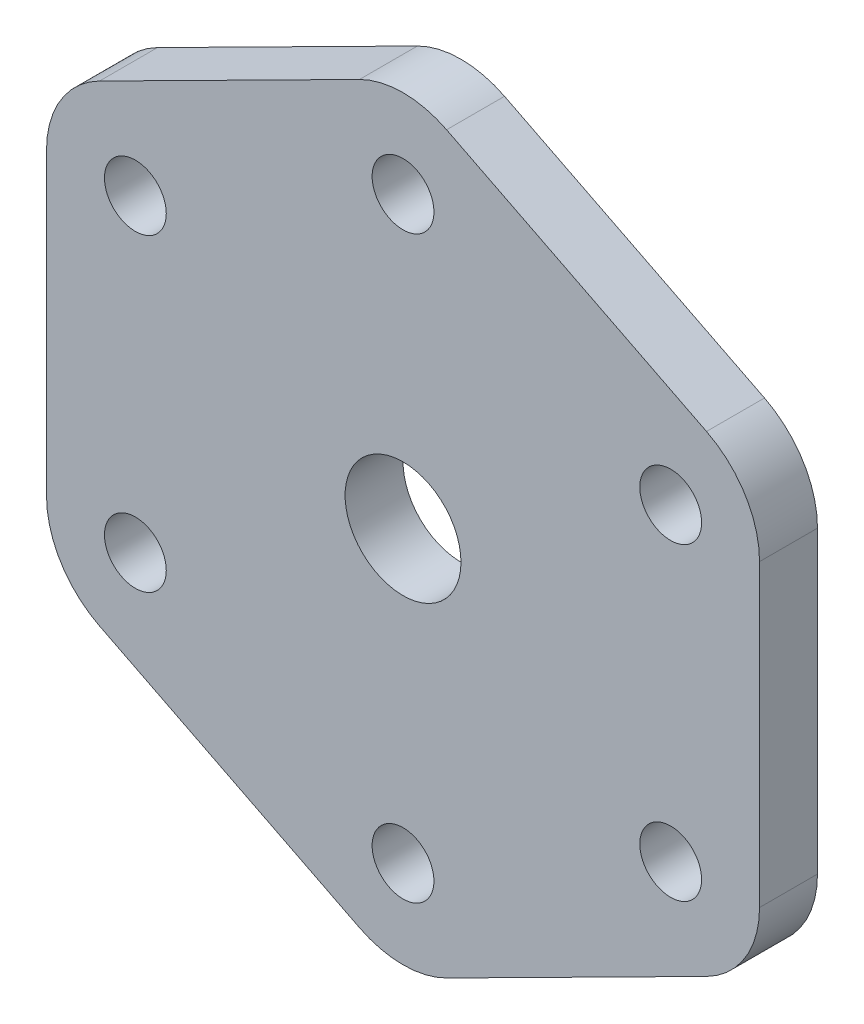
ISO-10303-21;
HEADER;
FILE_DESCRIPTION(('STEP AP214'),'2;1');
FILE_NAME('part.step','',(''),(''),'','','');
FILE_SCHEMA(('AUTOMOTIVE_DESIGN { 1 0 10303 214 1 1 1 1 }'));
ENDSEC;
DATA;
#1=APPLICATION_CONTEXT('core data for automotive mechanical design processes');
#2=APPLICATION_PROTOCOL_DEFINITION('international standard','automotive_design',2000,#1);
#3=PRODUCT_CONTEXT('',#1,'mechanical');
#4=PRODUCT('Part','Part','',(#3));
#5=PRODUCT_RELATED_PRODUCT_CATEGORY('part','',(#4));
#6=PRODUCT_DEFINITION_FORMATION('','',#4);
#7=PRODUCT_DEFINITION_CONTEXT('part definition',#1,'design');
#8=PRODUCT_DEFINITION('design','',#6,#7);
#9=PRODUCT_DEFINITION_SHAPE('','',#8);
#10=(LENGTH_UNIT() NAMED_UNIT(*) SI_UNIT(.MILLI.,.METRE.));
#11=(NAMED_UNIT(*) PLANE_ANGLE_UNIT() SI_UNIT($,.RADIAN.));
#12=(NAMED_UNIT(*) SI_UNIT($,.STERADIAN.) SOLID_ANGLE_UNIT());
#13=UNCERTAINTY_MEASURE_WITH_UNIT(LENGTH_MEASURE(1.E-05),#10,'distance_accuracy_value','');
#14=(GEOMETRIC_REPRESENTATION_CONTEXT(3) GLOBAL_UNCERTAINTY_ASSIGNED_CONTEXT((#13)) GLOBAL_UNIT_ASSIGNED_CONTEXT((#10,
#11,#12)) REPRESENTATION_CONTEXT('',''));
#15=CARTESIAN_POINT('',(0.,0.,0.));
#16=DIRECTION('',(0.,0.,1.));
#17=DIRECTION('',(1.,0.,0.));
#18=AXIS2_PLACEMENT_3D('',#15,#16,#17);
#19=CARTESIAN_POINT('',(13.456405,7.75392828392012,-10.));
#20=DIRECTION('',(0.,0.,-1.));
#21=DIRECTION('',(-1.,0.,0.));
#22=AXIS2_PLACEMENT_3D('',#19,#20,#21);
#23=CYLINDRICAL_SURFACE('',#22,4.99999999999998);
#24=CARTESIAN_POINT('',(13.456405,7.75392828392012,-13.));
#25=DIRECTION('',(0.,0.,-1.));
#26=DIRECTION('',(-1.,0.,0.));
#27=AXIS2_PLACEMENT_3D('',#24,#25,#26);
#28=CIRCLE('',#27,4.99999999999998);
#29=CARTESIAN_POINT('',(15.7109533817287,12.2167762081098,-13.));
#30=VERTEX_POINT('',#29);
#31=CARTESIAN_POINT('',(18.456405,7.75392828392007,-13.));
#32=VERTEX_POINT('',#31);
#33=EDGE_CURVE('E154',#30,#32,#28,.T.);
#34=ORIENTED_EDGE('',*,*,#33,.F.);
#35=DIRECTION('',(0.,0.,-1.));
#36=VECTOR('',#35,1.);
#37=CARTESIAN_POINT('',(15.7109533817287,12.2167762081098,-10.));
#38=LINE('',#37,#36);
#39=CARTESIAN_POINT('',(15.7109533817287,12.2167762081098,-10.));
#40=VERTEX_POINT('',#39);
#41=EDGE_CURVE('E11',#40,#30,#38,.T.);
#42=ORIENTED_EDGE('',*,*,#41,.F.);
#43=CARTESIAN_POINT('',(13.456405,7.75392828392012,-10.));
#44=DIRECTION('',(0.,0.,-1.));
#45=DIRECTION('',(-1.,0.,0.));
#46=AXIS2_PLACEMENT_3D('',#43,#44,#45);
#47=CIRCLE('',#46,4.99999999999998);
#48=CARTESIAN_POINT('',(18.456405,7.75392828392007,-10.));
#49=VERTEX_POINT('',#48);
#50=EDGE_CURVE('E187',#40,#49,#47,.T.);
#51=ORIENTED_EDGE('',*,*,#50,.T.);
#52=DIRECTION('',(0.,0.,-1.));
#53=VECTOR('',#52,1.);
#54=CARTESIAN_POINT('',(18.456405,7.75392828392007,-10.));
#55=LINE('',#54,#53);
#56=EDGE_CURVE('E36',#49,#32,#55,.T.);
#57=ORIENTED_EDGE('',*,*,#56,.T.);
#58=EDGE_LOOP('',(#34,#42,#51,#57));
#59=FACE_BOUND('',#58,.T.);
#60=ADVANCED_FACE('F33',(#59),#23,.T.);
#61=CARTESIAN_POINT('',(2.25454838172876,19.0147035925938,-10.));
#62=DIRECTION('',(0.450909676345752,0.892569584837938,0.));
#63=DIRECTION('',(-0.892569584837938,0.450909676345752,0.));
#64=AXIS2_PLACEMENT_3D('',#61,#62,#63);
#65=PLANE('',#64);
#66=DIRECTION('',(0.892569584837938,-0.450909676345752,0.));
#67=VECTOR('',#66,1.);
#68=CARTESIAN_POINT('',(2.25454838172876,19.0147035925938,-13.));
#69=LINE('',#68,#67);
#70=CARTESIAN_POINT('',(2.25454838172878,19.0147035925938,-13.));
#71=VERTEX_POINT('',#70);
#72=EDGE_CURVE('E185',#71,#30,#69,.T.);
#73=ORIENTED_EDGE('',*,*,#72,.F.);
#74=DIRECTION('',(0.,0.,-1.));
#75=VECTOR('',#74,1.);
#76=CARTESIAN_POINT('',(2.25454838172878,19.0147035925938,-10.));
#77=LINE('',#76,#75);
#78=CARTESIAN_POINT('',(2.25454838172878,19.0147035925938,-10.));
#79=VERTEX_POINT('',#78);
#80=EDGE_CURVE('E42',#79,#71,#77,.T.);
#81=ORIENTED_EDGE('',*,*,#80,.F.);
#82=DIRECTION('',(0.892569584837938,-0.450909676345752,0.));
#83=VECTOR('',#82,1.);
#84=CARTESIAN_POINT('',(2.25454838172876,19.0147035925938,-10.));
#85=LINE('',#84,#83);
#86=EDGE_CURVE('E144',#79,#40,#85,.T.);
#87=ORIENTED_EDGE('',*,*,#86,.T.);
#88=ORIENTED_EDGE('',*,*,#41,.T.);
#89=EDGE_LOOP('',(#73,#81,#87,#88));
#90=FACE_BOUND('',#89,.T.);
#91=ADVANCED_FACE('F207',(#90),#65,.T.);
#92=CARTESIAN_POINT('',(0.,14.5518556684041,-10.));
#93=DIRECTION('',(0.,0.,-1.));
#94=DIRECTION('',(-1.,0.,0.));
#95=AXIS2_PLACEMENT_3D('',#92,#93,#94);
#96=CYLINDRICAL_SURFACE('',#95,5.);
#97=CARTESIAN_POINT('',(0.,14.5518556684041,-13.));
#98=DIRECTION('',(0.,0.,-1.));
#99=DIRECTION('',(-1.,0.,0.));
#100=AXIS2_PLACEMENT_3D('',#97,#98,#99);
#101=CIRCLE('',#100,5.);
#102=CARTESIAN_POINT('',(-2.25454838172959,19.0147035925934,-13.));
#103=VERTEX_POINT('',#102);
#104=EDGE_CURVE('E131',#103,#71,#101,.T.);
#105=ORIENTED_EDGE('',*,*,#104,.F.);
#106=DIRECTION('',(0.,0.,-1.));
#107=VECTOR('',#106,1.);
#108=CARTESIAN_POINT('',(-2.25454838172959,19.0147035925934,-10.));
#109=LINE('',#108,#107);
#110=CARTESIAN_POINT('',(-2.25454838172959,19.0147035925934,-10.));
#111=VERTEX_POINT('',#110);
#112=EDGE_CURVE('E126',#111,#103,#109,.T.);
#113=ORIENTED_EDGE('',*,*,#112,.F.);
#114=CARTESIAN_POINT('',(0.,14.5518556684041,-10.));
#115=DIRECTION('',(0.,0.,-1.));
#116=DIRECTION('',(-1.,0.,0.));
#117=AXIS2_PLACEMENT_3D('',#114,#115,#116);
#118=CIRCLE('',#117,5.);
#119=EDGE_CURVE('E129',#111,#79,#118,.T.);
#120=ORIENTED_EDGE('',*,*,#119,.T.);
#121=ORIENTED_EDGE('',*,*,#80,.T.);
#122=EDGE_LOOP('',(#105,#113,#120,#121));
#123=FACE_BOUND('',#122,.T.);
#124=ADVANCED_FACE('F128',(#123),#96,.T.);
#125=CARTESIAN_POINT('',(-15.7109533817296,12.2167762081062,-10.));
#126=DIRECTION('',(-0.450909676345917,0.892569584837855,0.));
#127=DIRECTION('',(-0.892569584837855,-0.450909676345917,0.));
#128=AXIS2_PLACEMENT_3D('',#125,#126,#127);
#129=PLANE('',#128);
#130=DIRECTION('',(0.892569584837855,0.450909676345917,0.));
#131=VECTOR('',#130,1.);
#132=CARTESIAN_POINT('',(-15.7109533817296,12.2167762081062,-13.));
#133=LINE('',#132,#131);
#134=CARTESIAN_POINT('',(-15.7109533817296,12.2167762081062,-13.));
#135=VERTEX_POINT('',#134);
#136=EDGE_CURVE('E182',#135,#103,#133,.T.);
#137=ORIENTED_EDGE('',*,*,#136,.F.);
#138=DIRECTION('',(0.,0.,-1.));
#139=VECTOR('',#138,1.);
#140=CARTESIAN_POINT('',(-15.7109533817296,12.2167762081062,-10.));
#141=LINE('',#140,#139);
#142=CARTESIAN_POINT('',(-15.7109533817296,12.2167762081062,-10.));
#143=VERTEX_POINT('',#142);
#144=EDGE_CURVE('E136',#143,#135,#141,.T.);
#145=ORIENTED_EDGE('',*,*,#144,.F.);
#146=DIRECTION('',(0.892569584837855,0.450909676345917,0.));
#147=VECTOR('',#146,1.);
#148=CARTESIAN_POINT('',(-15.7109533817296,12.2167762081062,-10.));
#149=LINE('',#148,#147);
#150=EDGE_CURVE('E142',#143,#111,#149,.T.);
#151=ORIENTED_EDGE('',*,*,#150,.T.);
#152=ORIENTED_EDGE('',*,*,#112,.T.);
#153=EDGE_LOOP('',(#137,#145,#151,#152));
#154=FACE_BOUND('',#153,.T.);
#155=ADVANCED_FACE('F146',(#154),#129,.T.);
#156=CARTESIAN_POINT('',(-13.456405,7.75392828391688,-10.));
#157=DIRECTION('',(0.,0.,-1.));
#158=DIRECTION('',(-1.,0.,0.));
#159=AXIS2_PLACEMENT_3D('',#156,#157,#158);
#160=CYLINDRICAL_SURFACE('',#159,5.00000000000002);
#161=CARTESIAN_POINT('',(-13.456405,7.75392828391688,-13.));
#162=DIRECTION('',(0.,0.,-1.));
#163=DIRECTION('',(-1.,0.,0.));
#164=AXIS2_PLACEMENT_3D('',#161,#162,#163);
#165=CIRCLE('',#164,5.00000000000002);
#166=CARTESIAN_POINT('',(-18.456405,7.75392828391694,-13.));
#167=VERTEX_POINT('',#166);
#168=EDGE_CURVE('E179',#167,#135,#165,.T.);
#169=ORIENTED_EDGE('',*,*,#168,.F.);
#170=DIRECTION('',(0.,0.,-1.));
#171=VECTOR('',#170,1.);
#172=CARTESIAN_POINT('',(-18.456405,7.75392828391694,-10.));
#173=LINE('',#172,#171);
#174=CARTESIAN_POINT('',(-18.456405,7.75392828391694,-10.));
#175=VERTEX_POINT('',#174);
#176=EDGE_CURVE('E191',#175,#167,#173,.T.);
#177=ORIENTED_EDGE('',*,*,#176,.F.);
#178=CARTESIAN_POINT('',(-13.456405,7.75392828391688,-10.));
#179=DIRECTION('',(0.,0.,-1.));
#180=DIRECTION('',(-1.,0.,0.));
#181=AXIS2_PLACEMENT_3D('',#178,#179,#180);
#182=CIRCLE('',#181,5.00000000000002);
#183=EDGE_CURVE('E147',#175,#143,#182,.T.);
#184=ORIENTED_EDGE('',*,*,#183,.T.);
#185=ORIENTED_EDGE('',*,*,#144,.T.);
#186=EDGE_LOOP('',(#169,#177,#184,#185));
#187=FACE_BOUND('',#186,.T.);
#188=ADVANCED_FACE('F220',(#187),#160,.T.);
#189=CARTESIAN_POINT('',(-18.456405,-7.75392828392024,-10.));
#190=DIRECTION('',(-1.,0.,0.));
#191=DIRECTION('',(0.,-1.,0.));
#192=AXIS2_PLACEMENT_3D('',#189,#190,#191);
#193=PLANE('',#192);
#194=DIRECTION('',(0.,1.,0.));
#195=VECTOR('',#194,1.);
#196=CARTESIAN_POINT('',(-18.456405,-7.75392828392024,-13.));
#197=LINE('',#196,#195);
#198=CARTESIAN_POINT('',(-18.456405,-7.75392828392024,-13.));
#199=VERTEX_POINT('',#198);
#200=EDGE_CURVE('E176',#199,#167,#197,.T.);
#201=ORIENTED_EDGE('',*,*,#200,.F.);
#202=DIRECTION('',(0.,0.,-1.));
#203=VECTOR('',#202,1.);
#204=CARTESIAN_POINT('',(-18.456405,-7.75392828392024,-10.));
#205=LINE('',#204,#203);
#206=CARTESIAN_POINT('',(-18.456405,-7.75392828392024,-10.));
#207=VERTEX_POINT('',#206);
#208=EDGE_CURVE('E193',#207,#199,#205,.T.);
#209=ORIENTED_EDGE('',*,*,#208,.F.);
#210=DIRECTION('',(0.,1.,0.));
#211=VECTOR('',#210,1.);
#212=CARTESIAN_POINT('',(-18.456405,-7.75392828392024,-10.));
#213=LINE('',#212,#211);
#214=EDGE_CURVE('E149',#207,#175,#213,.T.);
#215=ORIENTED_EDGE('',*,*,#214,.T.);
#216=ORIENTED_EDGE('',*,*,#176,.T.);
#217=EDGE_LOOP('',(#201,#209,#215,#216));
#218=FACE_BOUND('',#217,.T.);
#219=ADVANCED_FACE('F223',(#218),#193,.T.);
#220=CARTESIAN_POINT('',(-13.456405,-7.75392828392024,-10.));
#221=DIRECTION('',(0.,0.,-1.));
#222=DIRECTION('',(-1.,0.,0.));
#223=AXIS2_PLACEMENT_3D('',#220,#221,#222);
#224=CYLINDRICAL_SURFACE('',#223,4.99999999999999);
#225=CARTESIAN_POINT('',(-13.456405,-7.75392828392024,-13.));
#226=DIRECTION('',(0.,0.,-1.));
#227=DIRECTION('',(-1.,0.,0.));
#228=AXIS2_PLACEMENT_3D('',#225,#226,#227);
#229=CIRCLE('',#228,4.99999999999999);
#230=CARTESIAN_POINT('',(-15.7109533817288,-12.2167762081099,-13.));
#231=VERTEX_POINT('',#230);
#232=EDGE_CURVE('E173',#231,#199,#229,.T.);
#233=ORIENTED_EDGE('',*,*,#232,.F.);
#234=DIRECTION('',(0.,0.,-1.));
#235=VECTOR('',#234,1.);
#236=CARTESIAN_POINT('',(-15.7109533817288,-12.2167762081099,-10.));
#237=LINE('',#236,#235);
#238=CARTESIAN_POINT('',(-15.7109533817288,-12.2167762081099,-10.));
#239=VERTEX_POINT('',#238);
#240=EDGE_CURVE('E195',#239,#231,#237,.T.);
#241=ORIENTED_EDGE('',*,*,#240,.F.);
#242=CARTESIAN_POINT('',(-13.456405,-7.75392828392024,-10.));
#243=DIRECTION('',(0.,0.,-1.));
#244=DIRECTION('',(-1.,0.,0.));
#245=AXIS2_PLACEMENT_3D('',#242,#243,#244);
#246=CIRCLE('',#245,4.99999999999999);
#247=EDGE_CURVE('E347',#239,#207,#246,.T.);
#248=ORIENTED_EDGE('',*,*,#247,.T.);
#249=ORIENTED_EDGE('',*,*,#208,.T.);
#250=EDGE_LOOP('',(#233,#241,#248,#249));
#251=FACE_BOUND('',#250,.T.);
#252=ADVANCED_FACE('F227',(#251),#224,.T.);
#253=CARTESIAN_POINT('',(-2.2545483817288,-19.014703592594,-10.));
#254=DIRECTION('',(-0.450909676345755,-0.892569584837936,0.));
#255=DIRECTION('',(0.892569584837936,-0.450909676345755,0.));
#256=AXIS2_PLACEMENT_3D('',#253,#254,#255);
#257=PLANE('',#256);
#258=DIRECTION('',(-0.892569584837936,0.450909676345755,0.));
#259=VECTOR('',#258,1.);
#260=CARTESIAN_POINT('',(-2.2545483817288,-19.014703592594,-13.));
#261=LINE('',#260,#259);
#262=CARTESIAN_POINT('',(-2.2545483817288,-19.014703592594,-13.));
#263=VERTEX_POINT('',#262);
#264=EDGE_CURVE('E170',#263,#231,#261,.T.);
#265=ORIENTED_EDGE('',*,*,#264,.F.);
#266=DIRECTION('',(0.,0.,-1.));
#267=VECTOR('',#266,1.);
#268=CARTESIAN_POINT('',(-2.2545483817288,-19.014703592594,-10.));
#269=LINE('',#268,#267);
#270=CARTESIAN_POINT('',(-2.2545483817288,-19.014703592594,-10.));
#271=VERTEX_POINT('',#270);
#272=EDGE_CURVE('E197',#271,#263,#269,.T.);
#273=ORIENTED_EDGE('',*,*,#272,.F.);
#274=DIRECTION('',(-0.892569584837936,0.450909676345755,0.));
#275=VECTOR('',#274,1.);
#276=CARTESIAN_POINT('',(-2.2545483817288,-19.014703592594,-10.));
#277=LINE('',#276,#275);
#278=EDGE_CURVE('E344',#271,#239,#277,.T.);
#279=ORIENTED_EDGE('',*,*,#278,.T.);
#280=ORIENTED_EDGE('',*,*,#240,.T.);
#281=EDGE_LOOP('',(#265,#273,#279,#280));
#282=FACE_BOUND('',#281,.T.);
#283=ADVANCED_FACE('F231',(#282),#257,.T.);
#284=CARTESIAN_POINT('',(0.,-14.5518556684043,-10.));
#285=DIRECTION('',(0.,0.,-1.));
#286=DIRECTION('',(-1.,0.,0.));
#287=AXIS2_PLACEMENT_3D('',#284,#285,#286);
#288=CYLINDRICAL_SURFACE('',#287,4.99999999999998);
#289=CARTESIAN_POINT('',(0.,-14.5518556684043,-13.));
#290=DIRECTION('',(0.,0.,-1.));
#291=DIRECTION('',(-1.,0.,0.));
#292=AXIS2_PLACEMENT_3D('',#289,#290,#291);
#293=CIRCLE('',#292,4.99999999999998);
#294=CARTESIAN_POINT('',(2.25454838172874,-19.014703592594,-13.));
#295=VERTEX_POINT('',#294);
#296=EDGE_CURVE('E167',#295,#263,#293,.T.);
#297=ORIENTED_EDGE('',*,*,#296,.F.);
#298=DIRECTION('',(0.,0.,-1.));
#299=VECTOR('',#298,1.);
#300=CARTESIAN_POINT('',(2.25454838172874,-19.014703592594,-10.));
#301=LINE('',#300,#299);
#302=CARTESIAN_POINT('',(2.25454838172874,-19.014703592594,-10.));
#303=VERTEX_POINT('',#302);
#304=EDGE_CURVE('E199',#303,#295,#301,.T.);
#305=ORIENTED_EDGE('',*,*,#304,.F.);
#306=CARTESIAN_POINT('',(0.,-14.5518556684043,-10.));
#307=DIRECTION('',(0.,0.,-1.));
#308=DIRECTION('',(-1.,0.,0.));
#309=AXIS2_PLACEMENT_3D('',#306,#307,#308);
#310=CIRCLE('',#309,4.99999999999998);
#311=EDGE_CURVE('E341',#303,#271,#310,.T.);
#312=ORIENTED_EDGE('',*,*,#311,.T.);
#313=ORIENTED_EDGE('',*,*,#272,.T.);
#314=EDGE_LOOP('',(#297,#305,#312,#313));
#315=FACE_BOUND('',#314,.T.);
#316=ADVANCED_FACE('F235',(#315),#288,.T.);
#317=CARTESIAN_POINT('',(15.7109533817287,-12.21677620811,-10.));
#318=DIRECTION('',(0.450909676345751,-0.892569584837939,0.));
#319=DIRECTION('',(0.892569584837939,0.450909676345751,0.));
#320=AXIS2_PLACEMENT_3D('',#317,#318,#319);
#321=PLANE('',#320);
#322=DIRECTION('',(-0.892569584837939,-0.450909676345751,0.));
#323=VECTOR('',#322,1.);
#324=CARTESIAN_POINT('',(15.7109533817287,-12.21677620811,-13.));
#325=LINE('',#324,#323);
#326=CARTESIAN_POINT('',(15.7109533817287,-12.21677620811,-13.));
#327=VERTEX_POINT('',#326);
#328=EDGE_CURVE('E164',#327,#295,#325,.T.);
#329=ORIENTED_EDGE('',*,*,#328,.F.);
#330=DIRECTION('',(0.,0.,-1.));
#331=VECTOR('',#330,1.);
#332=CARTESIAN_POINT('',(15.7109533817287,-12.21677620811,-10.));
#333=LINE('',#332,#331);
#334=CARTESIAN_POINT('',(15.7109533817287,-12.21677620811,-10.));
#335=VERTEX_POINT('',#334);
#336=EDGE_CURVE('E201',#335,#327,#333,.T.);
#337=ORIENTED_EDGE('',*,*,#336,.F.);
#338=DIRECTION('',(-0.892569584837939,-0.450909676345751,0.));
#339=VECTOR('',#338,1.);
#340=CARTESIAN_POINT('',(15.7109533817287,-12.21677620811,-10.));
#341=LINE('',#340,#339);
#342=EDGE_CURVE('E338',#335,#303,#341,.T.);
#343=ORIENTED_EDGE('',*,*,#342,.T.);
#344=ORIENTED_EDGE('',*,*,#304,.T.);
#345=EDGE_LOOP('',(#329,#337,#343,#344));
#346=FACE_BOUND('',#345,.T.);
#347=ADVANCED_FACE('F239',(#346),#321,.T.);
#348=CARTESIAN_POINT('',(13.456405,-7.75392828392032,-10.));
#349=DIRECTION('',(0.,0.,-1.));
#350=DIRECTION('',(-1.,0.,0.));
#351=AXIS2_PLACEMENT_3D('',#348,#349,#350);
#352=CYLINDRICAL_SURFACE('',#351,4.99999999999998);
#353=CARTESIAN_POINT('',(13.456405,-7.75392828392032,-13.));
#354=DIRECTION('',(0.,0.,-1.));
#355=DIRECTION('',(-1.,0.,0.));
#356=AXIS2_PLACEMENT_3D('',#353,#354,#355);
#357=CIRCLE('',#356,4.99999999999998);
#358=CARTESIAN_POINT('',(18.456405,-7.75392828392029,-13.));
#359=VERTEX_POINT('',#358);
#360=EDGE_CURVE('E161',#359,#327,#357,.T.);
#361=ORIENTED_EDGE('',*,*,#360,.F.);
#362=DIRECTION('',(0.,0.,-1.));
#363=VECTOR('',#362,1.);
#364=CARTESIAN_POINT('',(18.456405,-7.75392828392029,-10.));
#365=LINE('',#364,#363);
#366=CARTESIAN_POINT('',(18.456405,-7.75392828392029,-10.));
#367=VERTEX_POINT('',#366);
#368=EDGE_CURVE('E202',#367,#359,#365,.T.);
#369=ORIENTED_EDGE('',*,*,#368,.F.);
#370=CARTESIAN_POINT('',(13.456405,-7.75392828392032,-10.));
#371=DIRECTION('',(0.,0.,-1.));
#372=DIRECTION('',(-1.,0.,0.));
#373=AXIS2_PLACEMENT_3D('',#370,#371,#372);
#374=CIRCLE('',#373,4.99999999999998);
#375=EDGE_CURVE('E335',#367,#335,#374,.T.);
#376=ORIENTED_EDGE('',*,*,#375,.T.);
#377=ORIENTED_EDGE('',*,*,#336,.T.);
#378=EDGE_LOOP('',(#361,#369,#376,#377));
#379=FACE_BOUND('',#378,.T.);
#380=ADVANCED_FACE('F243',(#379),#352,.T.);
#381=CARTESIAN_POINT('',(18.456405,7.75392828392007,-10.));
#382=DIRECTION('',(1.,0.,0.));
#383=DIRECTION('',(0.,1.,0.));
#384=AXIS2_PLACEMENT_3D('',#381,#382,#383);
#385=PLANE('',#384);
#386=DIRECTION('',(0.,-1.,0.));
#387=VECTOR('',#386,1.);
#388=CARTESIAN_POINT('',(18.456405,7.75392828392007,-13.));
#389=LINE('',#388,#387);
#390=EDGE_CURVE('E157',#32,#359,#389,.T.);
#391=ORIENTED_EDGE('',*,*,#390,.F.);
#392=ORIENTED_EDGE('',*,*,#56,.F.);
#393=DIRECTION('',(0.,-1.,0.));
#394=VECTOR('',#393,1.);
#395=CARTESIAN_POINT('',(18.456405,7.75392828392007,-10.));
#396=LINE('',#395,#394);
#397=EDGE_CURVE('E333',#49,#367,#396,.T.);
#398=ORIENTED_EDGE('',*,*,#397,.T.);
#399=ORIENTED_EDGE('',*,*,#368,.T.);
#400=EDGE_LOOP('',(#391,#392,#398,#399));
#401=FACE_BOUND('',#400,.T.);
#402=ADVANCED_FACE('F204',(#401),#385,.T.);
#403=CARTESIAN_POINT('',(13.456405,7.75392828392012,-10.));
#404=DIRECTION('',(0.,0.,-1.));
#405=DIRECTION('',(-1.,0.,0.));
#406=AXIS2_PLACEMENT_3D('',#403,#404,#405);
#407=PLANE('',#406);
#408=CARTESIAN_POINT('',(0.,-15.,-10.));
#409=DIRECTION('',(0.,0.,-1.));
#410=DIRECTION('',(1.,0.,0.));
#411=AXIS2_PLACEMENT_3D('',#408,#409,#410);
#412=CIRCLE('',#411,1.6);
#413=CARTESIAN_POINT('',(1.6,-15.,-10.));
#414=VERTEX_POINT('',#413);
#415=EDGE_CURVE('E290',#414,#414,#412,.T.);
#416=ORIENTED_EDGE('',*,*,#415,.T.);
#417=EDGE_LOOP('',(#416));
#418=FACE_BOUND('',#417,.T.);
#419=CARTESIAN_POINT('',(13.856405,-8.00000000000001,-10.));
#420=DIRECTION('',(0.,0.,-1.));
#421=DIRECTION('',(1.,0.,0.));
#422=AXIS2_PLACEMENT_3D('',#419,#420,#421);
#423=CIRCLE('',#422,1.6);
#424=CARTESIAN_POINT('',(15.456405,-8.00000000000001,-10.));
#425=VERTEX_POINT('',#424);
#426=EDGE_CURVE('E298',#425,#425,#423,.T.);
#427=ORIENTED_EDGE('',*,*,#426,.T.);
#428=EDGE_LOOP('',(#427));
#429=FACE_BOUND('',#428,.T.);
#430=CARTESIAN_POINT('',(0.,15.,-10.));
#431=DIRECTION('',(0.,0.,-1.));
#432=DIRECTION('',(1.,0.,0.));
#433=AXIS2_PLACEMENT_3D('',#430,#431,#432);
#434=CIRCLE('',#433,1.6);
#435=CARTESIAN_POINT('',(1.60000000000001,15.,-10.));
#436=VERTEX_POINT('',#435);
#437=EDGE_CURVE('E304',#436,#436,#434,.T.);
#438=ORIENTED_EDGE('',*,*,#437,.T.);
#439=EDGE_LOOP('',(#438));
#440=FACE_BOUND('',#439,.T.);
#441=CARTESIAN_POINT('',(0.,0.,-10.));
#442=DIRECTION('',(0.,0.,-1.));
#443=DIRECTION('',(1.,0.,0.));
#444=AXIS2_PLACEMENT_3D('',#441,#442,#443);
#445=CIRCLE('',#444,3.);
#446=CARTESIAN_POINT('',(3.,0.,-10.));
#447=VERTEX_POINT('',#446);
#448=EDGE_CURVE('E310',#447,#447,#445,.T.);
#449=ORIENTED_EDGE('',*,*,#448,.T.);
#450=EDGE_LOOP('',(#449));
#451=FACE_BOUND('',#450,.T.);
#452=CARTESIAN_POINT('',(-13.856405,7.99999999999999,-10.));
#453=DIRECTION('',(0.,0.,-1.));
#454=DIRECTION('',(1.,0.,0.));
#455=AXIS2_PLACEMENT_3D('',#452,#453,#454);
#456=CIRCLE('',#455,1.6);
#457=CARTESIAN_POINT('',(-12.256405,7.99999999999999,-10.));
#458=VERTEX_POINT('',#457);
#459=EDGE_CURVE('E316',#458,#458,#456,.T.);
#460=ORIENTED_EDGE('',*,*,#459,.T.);
#461=EDGE_LOOP('',(#460));
#462=FACE_BOUND('',#461,.T.);
#463=CARTESIAN_POINT('',(13.856405,7.99999999999999,-10.));
#464=DIRECTION('',(0.,0.,-1.));
#465=DIRECTION('',(1.,0.,0.));
#466=AXIS2_PLACEMENT_3D('',#463,#464,#465);
#467=CIRCLE('',#466,1.6);
#468=CARTESIAN_POINT('',(15.456405,7.99999999999999,-10.));
#469=VERTEX_POINT('',#468);
#470=EDGE_CURVE('E322',#469,#469,#467,.T.);
#471=ORIENTED_EDGE('',*,*,#470,.T.);
#472=EDGE_LOOP('',(#471));
#473=FACE_BOUND('',#472,.T.);
#474=CARTESIAN_POINT('',(-13.856405,-8.00000000000001,-10.));
#475=DIRECTION('',(0.,0.,-1.));
#476=DIRECTION('',(1.,0.,0.));
#477=AXIS2_PLACEMENT_3D('',#474,#475,#476);
#478=CIRCLE('',#477,1.6);
#479=CARTESIAN_POINT('',(-12.256405,-8.00000000000001,-10.));
#480=VERTEX_POINT('',#479);
#481=EDGE_CURVE('E158',#480,#480,#478,.T.);
#482=ORIENTED_EDGE('',*,*,#481,.T.);
#483=EDGE_LOOP('',(#482));
#484=FACE_BOUND('',#483,.T.);
#485=ORIENTED_EDGE('',*,*,#50,.F.);
#486=ORIENTED_EDGE('',*,*,#86,.F.);
#487=ORIENTED_EDGE('',*,*,#119,.F.);
#488=ORIENTED_EDGE('',*,*,#150,.F.);
#489=ORIENTED_EDGE('',*,*,#183,.F.);
#490=ORIENTED_EDGE('',*,*,#214,.F.);
#491=ORIENTED_EDGE('',*,*,#247,.F.);
#492=ORIENTED_EDGE('',*,*,#278,.F.);
#493=ORIENTED_EDGE('',*,*,#311,.F.);
#494=ORIENTED_EDGE('',*,*,#342,.F.);
#495=ORIENTED_EDGE('',*,*,#375,.F.);
#496=ORIENTED_EDGE('',*,*,#397,.F.);
#497=EDGE_LOOP('',(#485,#486,#487,#488,#489,#490,#491,#492,#493,#494,#495,#496));
#498=FACE_BOUND('',#497,.T.);
#499=ADVANCED_FACE('F140',(#418,#429,#440,#451,#462,#473,#484,#498),#407,.F.);
#500=CARTESIAN_POINT('',(13.456405,7.75392828392012,-13.));
#501=DIRECTION('',(0.,0.,-1.));
#502=DIRECTION('',(-1.,0.,0.));
#503=AXIS2_PLACEMENT_3D('',#500,#501,#502);
#504=PLANE('',#503);
#505=CARTESIAN_POINT('',(0.,-15.,-13.));
#506=DIRECTION('',(0.,0.,-1.));
#507=DIRECTION('',(1.,0.,0.));
#508=AXIS2_PLACEMENT_3D('',#505,#506,#507);
#509=CIRCLE('',#508,1.6);
#510=CARTESIAN_POINT('',(1.6,-15.,-13.));
#511=VERTEX_POINT('',#510);
#512=EDGE_CURVE('E293',#511,#511,#509,.T.);
#513=ORIENTED_EDGE('',*,*,#512,.F.);
#514=EDGE_LOOP('',(#513));
#515=FACE_BOUND('',#514,.T.);
#516=CARTESIAN_POINT('',(13.856405,-8.00000000000001,-13.));
#517=DIRECTION('',(0.,0.,-1.));
#518=DIRECTION('',(1.,0.,0.));
#519=AXIS2_PLACEMENT_3D('',#516,#517,#518);
#520=CIRCLE('',#519,1.6);
#521=CARTESIAN_POINT('',(15.456405,-8.00000000000001,-13.));
#522=VERTEX_POINT('',#521);
#523=EDGE_CURVE('E295',#522,#522,#520,.T.);
#524=ORIENTED_EDGE('',*,*,#523,.F.);
#525=EDGE_LOOP('',(#524));
#526=FACE_BOUND('',#525,.T.);
#527=CARTESIAN_POINT('',(0.,15.,-13.));
#528=DIRECTION('',(0.,0.,-1.));
#529=DIRECTION('',(1.,0.,0.));
#530=AXIS2_PLACEMENT_3D('',#527,#528,#529);
#531=CIRCLE('',#530,1.6);
#532=CARTESIAN_POINT('',(1.60000000000001,15.,-13.));
#533=VERTEX_POINT('',#532);
#534=EDGE_CURVE('E301',#533,#533,#531,.T.);
#535=ORIENTED_EDGE('',*,*,#534,.F.);
#536=EDGE_LOOP('',(#535));
#537=FACE_BOUND('',#536,.T.);
#538=CARTESIAN_POINT('',(0.,0.,-13.));
#539=DIRECTION('',(0.,0.,-1.));
#540=DIRECTION('',(1.,0.,0.));
#541=AXIS2_PLACEMENT_3D('',#538,#539,#540);
#542=CIRCLE('',#541,3.);
#543=CARTESIAN_POINT('',(3.,0.,-13.));
#544=VERTEX_POINT('',#543);
#545=EDGE_CURVE('E307',#544,#544,#542,.T.);
#546=ORIENTED_EDGE('',*,*,#545,.F.);
#547=EDGE_LOOP('',(#546));
#548=FACE_BOUND('',#547,.T.);
#549=CARTESIAN_POINT('',(-13.856405,7.99999999999999,-13.));
#550=DIRECTION('',(0.,0.,-1.));
#551=DIRECTION('',(1.,0.,0.));
#552=AXIS2_PLACEMENT_3D('',#549,#550,#551);
#553=CIRCLE('',#552,1.6);
#554=CARTESIAN_POINT('',(-12.256405,7.99999999999999,-13.));
#555=VERTEX_POINT('',#554);
#556=EDGE_CURVE('E313',#555,#555,#553,.T.);
#557=ORIENTED_EDGE('',*,*,#556,.F.);
#558=EDGE_LOOP('',(#557));
#559=FACE_BOUND('',#558,.T.);
#560=CARTESIAN_POINT('',(13.856405,7.99999999999999,-13.));
#561=DIRECTION('',(0.,0.,-1.));
#562=DIRECTION('',(1.,0.,0.));
#563=AXIS2_PLACEMENT_3D('',#560,#561,#562);
#564=CIRCLE('',#563,1.6);
#565=CARTESIAN_POINT('',(15.456405,7.99999999999999,-13.));
#566=VERTEX_POINT('',#565);
#567=EDGE_CURVE('E319',#566,#566,#564,.T.);
#568=ORIENTED_EDGE('',*,*,#567,.F.);
#569=EDGE_LOOP('',(#568));
#570=FACE_BOUND('',#569,.T.);
#571=CARTESIAN_POINT('',(-13.856405,-8.00000000000001,-13.));
#572=DIRECTION('',(0.,0.,-1.));
#573=DIRECTION('',(1.,0.,0.));
#574=AXIS2_PLACEMENT_3D('',#571,#572,#573);
#575=CIRCLE('',#574,1.6);
#576=CARTESIAN_POINT('',(-12.256405,-8.00000000000001,-13.));
#577=VERTEX_POINT('',#576);
#578=EDGE_CURVE('E325',#577,#577,#575,.T.);
#579=ORIENTED_EDGE('',*,*,#578,.F.);
#580=EDGE_LOOP('',(#579));
#581=FACE_BOUND('',#580,.T.);
#582=ORIENTED_EDGE('',*,*,#33,.T.);
#583=ORIENTED_EDGE('',*,*,#390,.T.);
#584=ORIENTED_EDGE('',*,*,#360,.T.);
#585=ORIENTED_EDGE('',*,*,#328,.T.);
#586=ORIENTED_EDGE('',*,*,#296,.T.);
#587=ORIENTED_EDGE('',*,*,#264,.T.);
#588=ORIENTED_EDGE('',*,*,#232,.T.);
#589=ORIENTED_EDGE('',*,*,#200,.T.);
#590=ORIENTED_EDGE('',*,*,#168,.T.);
#591=ORIENTED_EDGE('',*,*,#136,.T.);
#592=ORIENTED_EDGE('',*,*,#104,.T.);
#593=ORIENTED_EDGE('',*,*,#72,.T.);
#594=EDGE_LOOP('',(#582,#583,#584,#585,#586,#587,#588,#589,#590,#591,#592,#593));
#595=FACE_BOUND('',#594,.T.);
#596=ADVANCED_FACE('F206',(#515,#526,#537,#548,#559,#570,#581,#595),#504,.T.);
#597=CARTESIAN_POINT('',(-13.856405,-8.00000000000001,-10.));
#598=DIRECTION('',(0.,0.,-1.));
#599=DIRECTION('',(-1.,0.,0.));
#600=AXIS2_PLACEMENT_3D('',#597,#598,#599);
#601=CYLINDRICAL_SURFACE('',#600,1.6);
#602=ORIENTED_EDGE('',*,*,#481,.F.);
#603=EDGE_LOOP('',(#602));
#604=FACE_BOUND('',#603,.T.);
#605=ORIENTED_EDGE('',*,*,#578,.T.);
#606=EDGE_LOOP('',(#605));
#607=FACE_BOUND('',#606,.T.);
#608=ADVANCED_FACE('F255',(#604,#607),#601,.F.);
#609=CARTESIAN_POINT('',(13.856405,7.99999999999999,-10.));
#610=DIRECTION('',(0.,0.,-1.));
#611=DIRECTION('',(-1.,0.,0.));
#612=AXIS2_PLACEMENT_3D('',#609,#610,#611);
#613=CYLINDRICAL_SURFACE('',#612,1.6);
#614=ORIENTED_EDGE('',*,*,#470,.F.);
#615=EDGE_LOOP('',(#614));
#616=FACE_BOUND('',#615,.T.);
#617=ORIENTED_EDGE('',*,*,#567,.T.);
#618=EDGE_LOOP('',(#617));
#619=FACE_BOUND('',#618,.T.);
#620=ADVANCED_FACE('F262',(#616,#619),#613,.F.);
#621=CARTESIAN_POINT('',(-13.856405,7.99999999999999,-10.));
#622=DIRECTION('',(0.,0.,-1.));
#623=DIRECTION('',(-1.,0.,0.));
#624=AXIS2_PLACEMENT_3D('',#621,#622,#623);
#625=CYLINDRICAL_SURFACE('',#624,1.6);
#626=ORIENTED_EDGE('',*,*,#459,.F.);
#627=EDGE_LOOP('',(#626));
#628=FACE_BOUND('',#627,.T.);
#629=ORIENTED_EDGE('',*,*,#556,.T.);
#630=EDGE_LOOP('',(#629));
#631=FACE_BOUND('',#630,.T.);
#632=ADVANCED_FACE('F266',(#628,#631),#625,.F.);
#633=CARTESIAN_POINT('',(0.,0.,-10.));
#634=DIRECTION('',(0.,0.,-1.));
#635=DIRECTION('',(-1.,0.,0.));
#636=AXIS2_PLACEMENT_3D('',#633,#634,#635);
#637=CYLINDRICAL_SURFACE('',#636,3.);
#638=ORIENTED_EDGE('',*,*,#448,.F.);
#639=EDGE_LOOP('',(#638));
#640=FACE_BOUND('',#639,.T.);
#641=ORIENTED_EDGE('',*,*,#545,.T.);
#642=EDGE_LOOP('',(#641));
#643=FACE_BOUND('',#642,.T.);
#644=ADVANCED_FACE('F270',(#640,#643),#637,.F.);
#645=CARTESIAN_POINT('',(0.,15.,-10.));
#646=DIRECTION('',(0.,0.,-1.));
#647=DIRECTION('',(-1.,0.,0.));
#648=AXIS2_PLACEMENT_3D('',#645,#646,#647);
#649=CYLINDRICAL_SURFACE('',#648,1.6);
#650=ORIENTED_EDGE('',*,*,#437,.F.);
#651=EDGE_LOOP('',(#650));
#652=FACE_BOUND('',#651,.T.);
#653=ORIENTED_EDGE('',*,*,#534,.T.);
#654=EDGE_LOOP('',(#653));
#655=FACE_BOUND('',#654,.T.);
#656=ADVANCED_FACE('F274',(#652,#655),#649,.F.);
#657=CARTESIAN_POINT('',(13.856405,-8.00000000000001,-10.));
#658=DIRECTION('',(0.,0.,-1.));
#659=DIRECTION('',(-1.,0.,0.));
#660=AXIS2_PLACEMENT_3D('',#657,#658,#659);
#661=CYLINDRICAL_SURFACE('',#660,1.6);
#662=ORIENTED_EDGE('',*,*,#426,.F.);
#663=EDGE_LOOP('',(#662));
#664=FACE_BOUND('',#663,.T.);
#665=ORIENTED_EDGE('',*,*,#523,.T.);
#666=EDGE_LOOP('',(#665));
#667=FACE_BOUND('',#666,.T.);
#668=ADVANCED_FACE('F278',(#664,#667),#661,.F.);
#669=CARTESIAN_POINT('',(0.,-15.,-10.));
#670=DIRECTION('',(0.,0.,-1.));
#671=DIRECTION('',(-1.,0.,0.));
#672=AXIS2_PLACEMENT_3D('',#669,#670,#671);
#673=CYLINDRICAL_SURFACE('',#672,1.6);
#674=ORIENTED_EDGE('',*,*,#415,.F.);
#675=EDGE_LOOP('',(#674));
#676=FACE_BOUND('',#675,.T.);
#677=ORIENTED_EDGE('',*,*,#512,.T.);
#678=EDGE_LOOP('',(#677));
#679=FACE_BOUND('',#678,.T.);
#680=ADVANCED_FACE('F282',(#676,#679),#673,.F.);
#681=CLOSED_SHELL('',(#60,#91,#124,#155,#188,#219,#252,#283,#316,#347,#380,#402,#499,#596,#608,
#620,#632,#644,#656,#668,#680));
#682=MANIFOLD_SOLID_BREP('B2',#681);
#683=ADVANCED_BREP_SHAPE_REPRESENTATION('',(#18,#682),#14);
#684=SHAPE_DEFINITION_REPRESENTATION(#9,#683);
ENDSEC;
END-ISO-10303-21;
